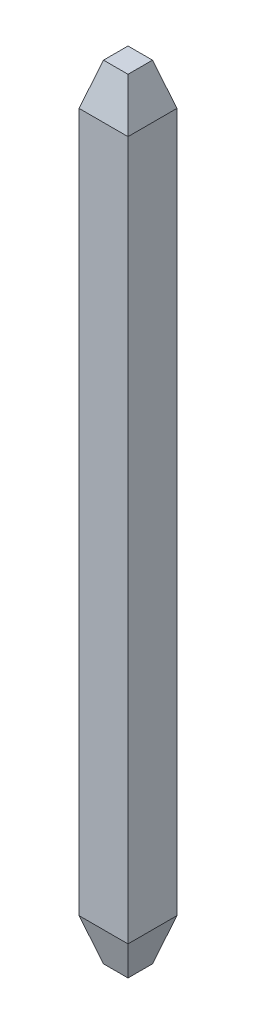
ISO-10303-21;
HEADER;
FILE_DESCRIPTION(('STEP AP214'),'2;1');
FILE_NAME('part.step','',(''),(''),'','','');
FILE_SCHEMA(('AUTOMOTIVE_DESIGN { 1 0 10303 214 1 1 1 1 }'));
ENDSEC;
DATA;
#1=APPLICATION_CONTEXT('core data for automotive mechanical design processes');
#2=APPLICATION_PROTOCOL_DEFINITION('international standard','automotive_design',2000,#1);
#3=PRODUCT_CONTEXT('',#1,'mechanical');
#4=PRODUCT('Part','Part','',(#3));
#5=PRODUCT_RELATED_PRODUCT_CATEGORY('part','',(#4));
#6=PRODUCT_DEFINITION_FORMATION('','',#4);
#7=PRODUCT_DEFINITION_CONTEXT('part definition',#1,'design');
#8=PRODUCT_DEFINITION('design','',#6,#7);
#9=PRODUCT_DEFINITION_SHAPE('','',#8);
#10=(LENGTH_UNIT() NAMED_UNIT(*) SI_UNIT(.MILLI.,.METRE.));
#11=(NAMED_UNIT(*) PLANE_ANGLE_UNIT() SI_UNIT($,.RADIAN.));
#12=(NAMED_UNIT(*) SI_UNIT($,.STERADIAN.) SOLID_ANGLE_UNIT());
#13=UNCERTAINTY_MEASURE_WITH_UNIT(LENGTH_MEASURE(1.E-05),#10,'distance_accuracy_value','');
#14=(GEOMETRIC_REPRESENTATION_CONTEXT(3) GLOBAL_UNCERTAINTY_ASSIGNED_CONTEXT((#13)) GLOBAL_UNIT_ASSIGNED_CONTEXT((#10,
#11,#12)) REPRESENTATION_CONTEXT('',''));
#15=CARTESIAN_POINT('',(0.,0.,0.));
#16=DIRECTION('',(0.,0.,1.));
#17=DIRECTION('',(1.,0.,0.));
#18=AXIS2_PLACEMENT_3D('',#15,#16,#17);
#19=CARTESIAN_POINT('',(9.05000000001295,-0.965870106912629,-16.6599999999763));
#20=DIRECTION('',(0.,0.281214622974643,0.959644900900968));
#21=DIRECTION('',(1.,0.,0.));
#22=AXIS2_PLACEMENT_3D('',#19,#20,#21);
#23=PLANE('',#22);
#24=DIRECTION('',(-0.270714017147727,0.923811583516618,-0.270714017147727));
#25=VECTOR('',#24,1.);
#26=CARTESIAN_POINT('',(9.37000000001295,-0.965870106912629,-16.6599999999763));
#27=LINE('',#26,#25);
#28=CARTESIAN_POINT('',(9.37000000001292,-0.965870106912631,-16.6599999999763));
#29=VERTEX_POINT('',#28);
#30=CARTESIAN_POINT('',(9.21000000001293,-0.419870106912631,-16.8199999999763));
#31=VERTEX_POINT('',#30);
#32=EDGE_CURVE('E11',#29,#31,#27,.T.);
#33=ORIENTED_EDGE('',*,*,#32,.T.);
#34=DIRECTION('',(-1.,0.,0.));
#35=VECTOR('',#34,1.);
#36=CARTESIAN_POINT('',(9.21000000001295,-0.419870106912629,-16.8199999999763));
#37=LINE('',#36,#35);
#38=CARTESIAN_POINT('',(8.89000000001293,-0.419870106912631,-16.8199999999763));
#39=VERTEX_POINT('',#38);
#40=EDGE_CURVE('E28',#31,#39,#37,.T.);
#41=ORIENTED_EDGE('',*,*,#40,.T.);
#42=DIRECTION('',(0.270714017147713,0.923811583516621,-0.270714017147728));
#43=VECTOR('',#42,1.);
#44=CARTESIAN_POINT('',(8.73000000001294,-0.965870106912629,-16.6599999999763));
#45=LINE('',#44,#43);
#46=CARTESIAN_POINT('',(8.73000000001294,-0.965870106912631,-16.6599999999763));
#47=VERTEX_POINT('',#46);
#48=EDGE_CURVE('E146',#47,#39,#45,.T.);
#49=ORIENTED_EDGE('',*,*,#48,.F.);
#50=DIRECTION('',(-1.,0.,0.));
#51=VECTOR('',#50,1.);
#52=CARTESIAN_POINT('',(9.37000000001295,-0.965870106912629,-16.6599999999763));
#53=LINE('',#52,#51);
#54=EDGE_CURVE('E142',#29,#47,#53,.T.);
#55=ORIENTED_EDGE('',*,*,#54,.F.);
#56=EDGE_LOOP('',(#33,#41,#49,#55));
#57=FACE_BOUND('',#56,.T.);
#58=ADVANCED_FACE('F17',(#57),#23,.T.);
#59=CARTESIAN_POINT('',(9.37000000001295,-0.965870106912629,-16.9799999999763));
#60=DIRECTION('',(0.959644900900968,0.281214622974643,0.));
#61=DIRECTION('',(0.,0.,-1.));
#62=AXIS2_PLACEMENT_3D('',#59,#60,#61);
#63=PLANE('',#62);
#64=DIRECTION('',(-0.270714017147727,0.923811583516618,0.270714017147727));
#65=VECTOR('',#64,1.);
#66=CARTESIAN_POINT('',(9.37000000001295,-0.965870106912629,-17.2999999999763));
#67=LINE('',#66,#65);
#68=CARTESIAN_POINT('',(9.37000000001292,-0.965870106912631,-17.2999999999763));
#69=VERTEX_POINT('',#68);
#70=CARTESIAN_POINT('',(9.21000000001293,-0.419870106912631,-17.1399999999763));
#71=VERTEX_POINT('',#70);
#72=EDGE_CURVE('E135',#69,#71,#67,.T.);
#73=ORIENTED_EDGE('',*,*,#72,.T.);
#74=DIRECTION('',(0.,0.,1.));
#75=VECTOR('',#74,1.);
#76=CARTESIAN_POINT('',(9.21000000001295,-0.419870106912629,-17.1399999999763));
#77=LINE('',#76,#75);
#78=EDGE_CURVE('E131',#71,#31,#77,.T.);
#79=ORIENTED_EDGE('',*,*,#78,.T.);
#80=ORIENTED_EDGE('',*,*,#32,.F.);
#81=DIRECTION('',(0.,0.,1.));
#82=VECTOR('',#81,1.);
#83=CARTESIAN_POINT('',(9.37000000001295,-0.965870106912629,-17.2999999999763));
#84=LINE('',#83,#82);
#85=EDGE_CURVE('E141',#69,#29,#84,.T.);
#86=ORIENTED_EDGE('',*,*,#85,.F.);
#87=EDGE_LOOP('',(#73,#79,#80,#86));
#88=FACE_BOUND('',#87,.T.);
#89=ADVANCED_FACE('F242',(#88),#63,.T.);
#90=CARTESIAN_POINT('',(9.05000000001295,-0.965870106912629,-17.2999999999763));
#91=DIRECTION('',(0.,0.281214622974643,-0.959644900900968));
#92=DIRECTION('',(-1.,0.,0.));
#93=AXIS2_PLACEMENT_3D('',#90,#91,#92);
#94=PLANE('',#93);
#95=DIRECTION('',(0.270714017147713,0.923811583516621,0.270714017147728));
#96=VECTOR('',#95,1.);
#97=CARTESIAN_POINT('',(8.73000000001294,-0.965870106912629,-17.2999999999763));
#98=LINE('',#97,#96);
#99=CARTESIAN_POINT('',(8.73000000001294,-0.965870106912631,-17.2999999999763));
#100=VERTEX_POINT('',#99);
#101=CARTESIAN_POINT('',(8.89000000001293,-0.419870106912631,-17.1399999999763));
#102=VERTEX_POINT('',#101);
#103=EDGE_CURVE('E136',#100,#102,#98,.T.);
#104=ORIENTED_EDGE('',*,*,#103,.T.);
#105=DIRECTION('',(1.,0.,0.));
#106=VECTOR('',#105,1.);
#107=CARTESIAN_POINT('',(8.89000000001293,-0.419870106912629,-17.1399999999763));
#108=LINE('',#107,#106);
#109=EDGE_CURVE('E21',#102,#71,#108,.T.);
#110=ORIENTED_EDGE('',*,*,#109,.T.);
#111=ORIENTED_EDGE('',*,*,#72,.F.);
#112=DIRECTION('',(1.,0.,0.));
#113=VECTOR('',#112,1.);
#114=CARTESIAN_POINT('',(8.73000000001294,-0.965870106912629,-17.2999999999763));
#115=LINE('',#114,#113);
#116=EDGE_CURVE('E196',#100,#69,#115,.T.);
#117=ORIENTED_EDGE('',*,*,#116,.F.);
#118=EDGE_LOOP('',(#104,#110,#111,#117));
#119=FACE_BOUND('',#118,.T.);
#120=ADVANCED_FACE('F225',(#119),#94,.T.);
#121=CARTESIAN_POINT('',(9.37100000001296,-5.53443505344787,-17.2999999999763));
#122=DIRECTION('',(0.,0.,-1.));
#123=DIRECTION('',(0.,-1.,0.));
#124=AXIS2_PLACEMENT_3D('',#121,#122,#123);
#125=PLANE('',#124);
#126=DIRECTION('',(0.,1.,0.));
#127=VECTOR('',#126,1.);
#128=CARTESIAN_POINT('',(9.37000000001295,-10.1039999999831,-17.2999999999763));
#129=LINE('',#128,#127);
#130=CARTESIAN_POINT('',(9.37000000001292,-10.1039999999831,-17.2999999999763));
#131=VERTEX_POINT('',#130);
#132=EDGE_CURVE('E130',#131,#69,#129,.T.);
#133=ORIENTED_EDGE('',*,*,#132,.F.);
#134=DIRECTION('',(1.,0.,0.));
#135=VECTOR('',#134,1.);
#136=CARTESIAN_POINT('',(8.73000000001294,-10.1039999999831,-17.2999999999763));
#137=LINE('',#136,#135);
#138=CARTESIAN_POINT('',(8.73000000001294,-10.1039999999831,-17.2999999999763));
#139=VERTEX_POINT('',#138);
#140=EDGE_CURVE('E129',#139,#131,#137,.T.);
#141=ORIENTED_EDGE('',*,*,#140,.F.);
#142=DIRECTION('',(0.,1.,0.));
#143=VECTOR('',#142,1.);
#144=CARTESIAN_POINT('',(8.73000000001294,-10.1039999999831,-17.2999999999763));
#145=LINE('',#144,#143);
#146=EDGE_CURVE('E200',#139,#100,#145,.T.);
#147=ORIENTED_EDGE('',*,*,#146,.T.);
#148=ORIENTED_EDGE('',*,*,#116,.T.);
#149=EDGE_LOOP('',(#133,#141,#147,#148));
#150=FACE_BOUND('',#149,.T.);
#151=ADVANCED_FACE('F228',(#150),#125,.T.);
#152=CARTESIAN_POINT('',(8.73000000001294,-5.53543505344786,-16.6589999999763));
#153=DIRECTION('',(-1.,0.,0.));
#154=DIRECTION('',(0.,0.,1.));
#155=AXIS2_PLACEMENT_3D('',#152,#153,#154);
#156=PLANE('',#155);
#157=ORIENTED_EDGE('',*,*,#146,.F.);
#158=DIRECTION('',(0.,0.,-1.));
#159=VECTOR('',#158,1.);
#160=CARTESIAN_POINT('',(8.73000000001294,-10.1039999999831,-16.6599999999763));
#161=LINE('',#160,#159);
#162=CARTESIAN_POINT('',(8.73000000001294,-10.1039999999831,-16.6599999999763));
#163=VERTEX_POINT('',#162);
#164=EDGE_CURVE('E167',#163,#139,#161,.T.);
#165=ORIENTED_EDGE('',*,*,#164,.F.);
#166=DIRECTION('',(0.,1.,0.));
#167=VECTOR('',#166,1.);
#168=CARTESIAN_POINT('',(8.73000000001294,-10.1039999999831,-16.6599999999763));
#169=LINE('',#168,#167);
#170=EDGE_CURVE('E173',#163,#47,#169,.T.);
#171=ORIENTED_EDGE('',*,*,#170,.T.);
#172=DIRECTION('',(0.,0.,-1.));
#173=VECTOR('',#172,1.);
#174=CARTESIAN_POINT('',(8.73000000001294,-0.965870106912629,-16.6599999999763));
#175=LINE('',#174,#173);
#176=EDGE_CURVE('E169',#47,#100,#175,.T.);
#177=ORIENTED_EDGE('',*,*,#176,.T.);
#178=EDGE_LOOP('',(#157,#165,#171,#177));
#179=FACE_BOUND('',#178,.T.);
#180=ADVANCED_FACE('F219',(#179),#156,.T.);
#181=CARTESIAN_POINT('',(8.73000000001294,-10.1039999999831,-16.9799999999763));
#182=DIRECTION('',(-0.959644900900972,-0.28121462297463,0.));
#183=DIRECTION('',(-0.28121462297463,0.959644900900972,0.));
#184=AXIS2_PLACEMENT_3D('',#181,#182,#183);
#185=PLANE('',#184);
#186=ORIENTED_EDGE('',*,*,#164,.T.);
#187=DIRECTION('',(0.270714017147714,-0.923811583516621,0.270714017147729));
#188=VECTOR('',#187,1.);
#189=CARTESIAN_POINT('',(8.73000000001294,-10.1039999999831,-17.2999999999763));
#190=LINE('',#189,#188);
#191=CARTESIAN_POINT('',(8.89000000001293,-10.6499999999831,-17.1399999999763));
#192=VERTEX_POINT('',#191);
#193=EDGE_CURVE('E163',#139,#192,#190,.T.);
#194=ORIENTED_EDGE('',*,*,#193,.T.);
#195=DIRECTION('',(0.,0.,-1.));
#196=VECTOR('',#195,1.);
#197=CARTESIAN_POINT('',(8.89000000001293,-10.6499999999831,-16.8199999999763));
#198=LINE('',#197,#196);
#199=CARTESIAN_POINT('',(8.89000000001293,-10.6499999999831,-16.8199999999763));
#200=VERTEX_POINT('',#199);
#201=EDGE_CURVE('E105',#200,#192,#198,.T.);
#202=ORIENTED_EDGE('',*,*,#201,.F.);
#203=DIRECTION('',(0.270714017147714,-0.923811583516621,-0.270714017147729));
#204=VECTOR('',#203,1.);
#205=CARTESIAN_POINT('',(8.73000000001294,-10.1039999999831,-16.6599999999763));
#206=LINE('',#205,#204);
#207=EDGE_CURVE('E99',#163,#200,#206,.T.);
#208=ORIENTED_EDGE('',*,*,#207,.F.);
#209=EDGE_LOOP('',(#186,#194,#202,#208));
#210=FACE_BOUND('',#209,.T.);
#211=ADVANCED_FACE('F233',(#210),#185,.T.);
#212=CARTESIAN_POINT('',(9.05000000001295,-10.1039999999831,-16.6599999999763));
#213=DIRECTION('',(0.,-0.281214622974644,0.959644900900968));
#214=DIRECTION('',(-1.,0.,0.));
#215=AXIS2_PLACEMENT_3D('',#212,#213,#214);
#216=PLANE('',#215);
#217=DIRECTION('',(-1.,0.,0.));
#218=VECTOR('',#217,1.);
#219=CARTESIAN_POINT('',(9.37000000001295,-10.1039999999831,-16.6599999999763));
#220=LINE('',#219,#218);
#221=CARTESIAN_POINT('',(9.37000000001292,-10.1039999999831,-16.6599999999763));
#222=VERTEX_POINT('',#221);
#223=EDGE_CURVE('E168',#222,#163,#220,.T.);
#224=ORIENTED_EDGE('',*,*,#223,.T.);
#225=ORIENTED_EDGE('',*,*,#207,.T.);
#226=DIRECTION('',(-1.,0.,0.));
#227=VECTOR('',#226,1.);
#228=CARTESIAN_POINT('',(9.21000000001295,-10.6499999999831,-16.8199999999763));
#229=LINE('',#228,#227);
#230=CARTESIAN_POINT('',(9.21000000001293,-10.6499999999831,-16.8199999999763));
#231=VERTEX_POINT('',#230);
#232=EDGE_CURVE('E93',#231,#200,#229,.T.);
#233=ORIENTED_EDGE('',*,*,#232,.F.);
#234=DIRECTION('',(-0.270714017147728,-0.923811583516617,-0.270714017147728));
#235=VECTOR('',#234,1.);
#236=CARTESIAN_POINT('',(9.37000000001295,-10.1039999999831,-16.6599999999763));
#237=LINE('',#236,#235);
#238=EDGE_CURVE('E97',#222,#231,#237,.T.);
#239=ORIENTED_EDGE('',*,*,#238,.F.);
#240=EDGE_LOOP('',(#224,#225,#233,#239));
#241=FACE_BOUND('',#240,.T.);
#242=ADVANCED_FACE('F96',(#241),#216,.T.);
#243=CARTESIAN_POINT('',(9.37000000001295,-10.1039999999831,-16.9799999999763));
#244=DIRECTION('',(0.959644900900968,-0.281214622974644,0.));
#245=DIRECTION('',(0.,0.,-1.));
#246=AXIS2_PLACEMENT_3D('',#243,#244,#245);
#247=PLANE('',#246);
#248=DIRECTION('',(0.,0.,1.));
#249=VECTOR('',#248,1.);
#250=CARTESIAN_POINT('',(9.37000000001295,-10.1039999999831,-17.2999999999763));
#251=LINE('',#250,#249);
#252=EDGE_CURVE('E112',#131,#222,#251,.T.);
#253=ORIENTED_EDGE('',*,*,#252,.T.);
#254=ORIENTED_EDGE('',*,*,#238,.T.);
#255=DIRECTION('',(0.,0.,1.));
#256=VECTOR('',#255,1.);
#257=CARTESIAN_POINT('',(9.21000000001295,-10.6499999999831,-17.1399999999763));
#258=LINE('',#257,#256);
#259=CARTESIAN_POINT('',(9.21000000001293,-10.6499999999831,-17.1399999999763));
#260=VERTEX_POINT('',#259);
#261=EDGE_CURVE('E104',#260,#231,#258,.T.);
#262=ORIENTED_EDGE('',*,*,#261,.F.);
#263=DIRECTION('',(-0.270714017147728,-0.923811583516617,0.270714017147728));
#264=VECTOR('',#263,1.);
#265=CARTESIAN_POINT('',(9.37000000001295,-10.1039999999831,-17.2999999999763));
#266=LINE('',#265,#264);
#267=EDGE_CURVE('E126',#131,#260,#266,.T.);
#268=ORIENTED_EDGE('',*,*,#267,.F.);
#269=EDGE_LOOP('',(#253,#254,#262,#268));
#270=FACE_BOUND('',#269,.T.);
#271=ADVANCED_FACE('F19',(#270),#247,.T.);
#272=CARTESIAN_POINT('',(8.88900000001296,-10.6499999999831,-16.9799999999763));
#273=DIRECTION('',(0.,-1.,0.));
#274=DIRECTION('',(0.,0.,-1.));
#275=AXIS2_PLACEMENT_3D('',#272,#273,#274);
#276=PLANE('',#275);
#277=ORIENTED_EDGE('',*,*,#261,.T.);
#278=ORIENTED_EDGE('',*,*,#232,.T.);
#279=ORIENTED_EDGE('',*,*,#201,.T.);
#280=DIRECTION('',(1.,0.,0.));
#281=VECTOR('',#280,1.);
#282=CARTESIAN_POINT('',(8.89000000001293,-10.6499999999831,-17.1399999999763));
#283=LINE('',#282,#281);
#284=EDGE_CURVE('E118',#192,#260,#283,.T.);
#285=ORIENTED_EDGE('',*,*,#284,.T.);
#286=EDGE_LOOP('',(#277,#278,#279,#285));
#287=FACE_BOUND('',#286,.T.);
#288=ADVANCED_FACE('F116',(#287),#276,.T.);
#289=CARTESIAN_POINT('',(9.05000000001295,-10.1039999999831,-17.2999999999763));
#290=DIRECTION('',(0.,-0.281214622974644,-0.959644900900968));
#291=DIRECTION('',(0.,-0.959644900900968,0.281214622974644));
#292=AXIS2_PLACEMENT_3D('',#289,#290,#291);
#293=PLANE('',#292);
#294=ORIENTED_EDGE('',*,*,#140,.T.);
#295=ORIENTED_EDGE('',*,*,#267,.T.);
#296=ORIENTED_EDGE('',*,*,#284,.F.);
#297=ORIENTED_EDGE('',*,*,#193,.F.);
#298=EDGE_LOOP('',(#294,#295,#296,#297));
#299=FACE_BOUND('',#298,.T.);
#300=ADVANCED_FACE('F231',(#299),#293,.T.);
#301=CARTESIAN_POINT('',(9.37000000001295,-11.0738701069126,-16.9799999999763));
#302=DIRECTION('',(1.,0.,0.));
#303=DIRECTION('',(0.,1.,0.));
#304=AXIS2_PLACEMENT_3D('',#301,#302,#303);
#305=PLANE('',#304);
#306=DIRECTION('',(0.,1.,0.));
#307=VECTOR('',#306,1.);
#308=CARTESIAN_POINT('',(9.37000000001295,-10.1039999999831,-16.6599999999763));
#309=LINE('',#308,#307);
#310=EDGE_CURVE('E137',#222,#29,#309,.T.);
#311=ORIENTED_EDGE('',*,*,#310,.F.);
#312=ORIENTED_EDGE('',*,*,#252,.F.);
#313=ORIENTED_EDGE('',*,*,#132,.T.);
#314=ORIENTED_EDGE('',*,*,#85,.T.);
#315=EDGE_LOOP('',(#311,#312,#313,#314));
#316=FACE_BOUND('',#315,.T.);
#317=ADVANCED_FACE('F247',(#316),#305,.T.);
#318=CARTESIAN_POINT('',(8.72900000001296,-5.53543505344787,-16.6599999999763));
#319=DIRECTION('',(0.,0.,1.));
#320=DIRECTION('',(1.,0.,0.));
#321=AXIS2_PLACEMENT_3D('',#318,#319,#320);
#322=PLANE('',#321);
#323=ORIENTED_EDGE('',*,*,#170,.F.);
#324=ORIENTED_EDGE('',*,*,#223,.F.);
#325=ORIENTED_EDGE('',*,*,#310,.T.);
#326=ORIENTED_EDGE('',*,*,#54,.T.);
#327=EDGE_LOOP('',(#323,#324,#325,#326));
#328=FACE_BOUND('',#327,.T.);
#329=ADVANCED_FACE('F245',(#328),#322,.T.);
#330=CARTESIAN_POINT('',(8.73000000001294,-0.965870106912629,-16.9799999999763));
#331=DIRECTION('',(-0.959644900900973,0.281214622974629,0.));
#332=DIRECTION('',(0.,0.,1.));
#333=AXIS2_PLACEMENT_3D('',#330,#331,#332);
#334=PLANE('',#333);
#335=ORIENTED_EDGE('',*,*,#48,.T.);
#336=DIRECTION('',(0.,0.,-1.));
#337=VECTOR('',#336,1.);
#338=CARTESIAN_POINT('',(8.89000000001293,-0.419870106912629,-16.8199999999763));
#339=LINE('',#338,#337);
#340=EDGE_CURVE('E143',#39,#102,#339,.T.);
#341=ORIENTED_EDGE('',*,*,#340,.T.);
#342=ORIENTED_EDGE('',*,*,#103,.F.);
#343=ORIENTED_EDGE('',*,*,#176,.F.);
#344=EDGE_LOOP('',(#335,#341,#342,#343));
#345=FACE_BOUND('',#344,.T.);
#346=ADVANCED_FACE('F223',(#345),#334,.T.);
#347=CARTESIAN_POINT('',(9.05000000001295,-0.419870106912629,-17.1409999999763));
#348=DIRECTION('',(0.,1.,0.));
#349=DIRECTION('',(1.,0.,0.));
#350=AXIS2_PLACEMENT_3D('',#347,#348,#349);
#351=PLANE('',#350);
#352=ORIENTED_EDGE('',*,*,#109,.F.);
#353=ORIENTED_EDGE('',*,*,#340,.F.);
#354=ORIENTED_EDGE('',*,*,#40,.F.);
#355=ORIENTED_EDGE('',*,*,#78,.F.);
#356=EDGE_LOOP('',(#352,#353,#354,#355));
#357=FACE_BOUND('',#356,.T.);
#358=ADVANCED_FACE('F240',(#357),#351,.T.);
#359=CLOSED_SHELL('',(#58,#89,#120,#151,#180,#211,#242,#271,#288,#300,#317,#329,#346,#358));
#360=MANIFOLD_SOLID_BREP('B1',#359);
#361=ADVANCED_BREP_SHAPE_REPRESENTATION('',(#18,#360),#14);
#362=SHAPE_DEFINITION_REPRESENTATION(#9,#361);
ENDSEC;
END-ISO-10303-21;
